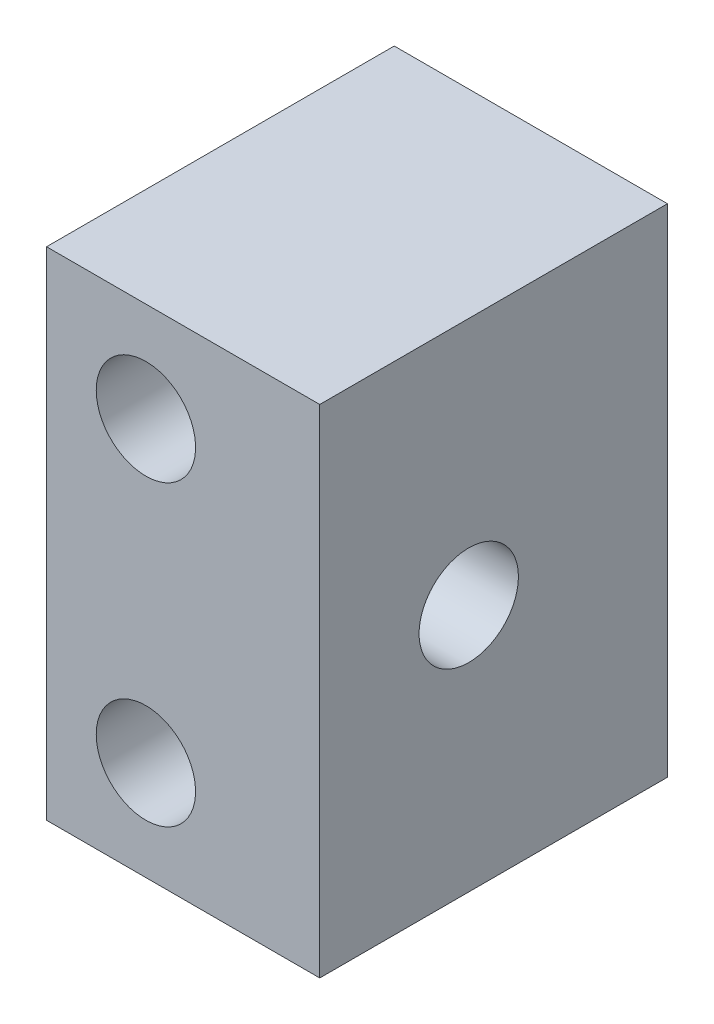
ISO-10303-21;
HEADER;
FILE_DESCRIPTION(('STEP AP214'),'2;1');
FILE_NAME('part.step','',(''),(''),'','','');
FILE_SCHEMA(('AUTOMOTIVE_DESIGN { 1 0 10303 214 1 1 1 1 }'));
ENDSEC;
DATA;
#1=APPLICATION_CONTEXT('core data for automotive mechanical design processes');
#2=APPLICATION_PROTOCOL_DEFINITION('international standard','automotive_design',2000,#1);
#3=PRODUCT_CONTEXT('',#1,'mechanical');
#4=PRODUCT('Part','Part','',(#3));
#5=PRODUCT_RELATED_PRODUCT_CATEGORY('part','',(#4));
#6=PRODUCT_DEFINITION_FORMATION('','',#4);
#7=PRODUCT_DEFINITION_CONTEXT('part definition',#1,'design');
#8=PRODUCT_DEFINITION('design','',#6,#7);
#9=PRODUCT_DEFINITION_SHAPE('','',#8);
#10=(LENGTH_UNIT() NAMED_UNIT(*) SI_UNIT(.MILLI.,.METRE.));
#11=(NAMED_UNIT(*) PLANE_ANGLE_UNIT() SI_UNIT($,.RADIAN.));
#12=(NAMED_UNIT(*) SI_UNIT($,.STERADIAN.) SOLID_ANGLE_UNIT());
#13=UNCERTAINTY_MEASURE_WITH_UNIT(LENGTH_MEASURE(1.E-05),#10,'distance_accuracy_value','');
#14=(GEOMETRIC_REPRESENTATION_CONTEXT(3) GLOBAL_UNCERTAINTY_ASSIGNED_CONTEXT((#13)) GLOBAL_UNIT_ASSIGNED_CONTEXT((#10,
#11,#12)) REPRESENTATION_CONTEXT('',''));
#15=CARTESIAN_POINT('',(0.,0.,0.));
#16=DIRECTION('',(0.,0.,1.));
#17=DIRECTION('',(1.,0.,0.));
#18=AXIS2_PLACEMENT_3D('',#15,#16,#17);
#19=CARTESIAN_POINT('',(194.999322294176,232.665580803044,4.));
#20=DIRECTION('',(0.,1.,0.));
#21=DIRECTION('',(0.,0.,1.));
#22=AXIS2_PLACEMENT_3D('',#19,#20,#21);
#23=PLANE('',#22);
#24=DIRECTION('',(-1.,0.,0.));
#25=VECTOR('',#24,1.);
#26=CARTESIAN_POINT('',(197.499322294176,232.665580803044,0.384450557859643));
#27=LINE('',#26,#25);
#28=CARTESIAN_POINT('',(197.499322294176,232.665580803044,0.384450557859643));
#29=VERTEX_POINT('',#28);
#30=CARTESIAN_POINT('',(194.999322294176,232.665580803044,0.384450557859643));
#31=VERTEX_POINT('',#30);
#32=EDGE_CURVE('E163',#29,#31,#27,.T.);
#33=ORIENTED_EDGE('',*,*,#32,.F.);
#34=DIRECTION('',(0.,0.,-1.));
#35=VECTOR('',#34,1.);
#36=CARTESIAN_POINT('',(197.499322294176,232.665580803044,4.));
#37=LINE('',#36,#35);
#38=CARTESIAN_POINT('',(197.499322294176,232.665580803044,0.));
#39=VERTEX_POINT('',#38);
#40=EDGE_CURVE('E345',#29,#39,#37,.T.);
#41=ORIENTED_EDGE('',*,*,#40,.T.);
#42=DIRECTION('',(1.,0.,0.));
#43=VECTOR('',#42,1.);
#44=CARTESIAN_POINT('',(194.999322294176,232.665580803044,0.));
#45=LINE('',#44,#43);
#46=CARTESIAN_POINT('',(194.999322294176,232.665580803044,0.));
#47=VERTEX_POINT('',#46);
#48=EDGE_CURVE('E328',#47,#39,#45,.T.);
#49=ORIENTED_EDGE('',*,*,#48,.F.);
#50=DIRECTION('',(0.,0.,-1.));
#51=VECTOR('',#50,1.);
#52=CARTESIAN_POINT('',(194.999322294176,232.665580803044,4.));
#53=LINE('',#52,#51);
#54=EDGE_CURVE('E340',#31,#47,#53,.T.);
#55=ORIENTED_EDGE('',*,*,#54,.F.);
#56=EDGE_LOOP('',(#33,#41,#49,#55));
#57=FACE_BOUND('',#56,.T.);
#58=ADVANCED_FACE('F119',(#57),#23,.T.);
#59=CARTESIAN_POINT('',(195.999322294176,234.665580803044,4.));
#60=DIRECTION('',(0.,1.,0.));
#61=DIRECTION('',(0.,0.,1.));
#62=AXIS2_PLACEMENT_3D('',#59,#60,#61);
#63=PLANE('',#62);
#64=DIRECTION('',(0.,0.,-1.));
#65=VECTOR('',#64,1.);
#66=CARTESIAN_POINT('',(197.499322294176,234.665580803044,4.));
#67=LINE('',#66,#65);
#68=CARTESIAN_POINT('',(197.499322294176,234.665580803044,0.384450557859643));
#69=VERTEX_POINT('',#68);
#70=CARTESIAN_POINT('',(197.499322294176,234.665580803044,0.));
#71=VERTEX_POINT('',#70);
#72=EDGE_CURVE('E322',#69,#71,#67,.T.);
#73=ORIENTED_EDGE('',*,*,#72,.F.);
#74=DIRECTION('',(-1.,0.,0.));
#75=VECTOR('',#74,1.);
#76=CARTESIAN_POINT('',(197.499322294176,234.665580803044,0.384450557859643));
#77=LINE('',#76,#75);
#78=CARTESIAN_POINT('',(194.999322294176,234.665580803044,0.384450557859643));
#79=VERTEX_POINT('',#78);
#80=EDGE_CURVE('E12',#69,#79,#77,.T.);
#81=ORIENTED_EDGE('',*,*,#80,.T.);
#82=DIRECTION('',(0.,0.,-1.));
#83=VECTOR('',#82,1.);
#84=CARTESIAN_POINT('',(194.999322294176,234.665580803044,4.));
#85=LINE('',#84,#83);
#86=CARTESIAN_POINT('',(194.999322294176,234.665580803044,0.));
#87=VERTEX_POINT('',#86);
#88=EDGE_CURVE('E335',#79,#87,#85,.T.);
#89=ORIENTED_EDGE('',*,*,#88,.T.);
#90=DIRECTION('',(1.,0.,0.));
#91=VECTOR('',#90,1.);
#92=CARTESIAN_POINT('',(195.999322294176,234.665580803044,0.));
#93=LINE('',#92,#91);
#94=EDGE_CURVE('E307',#87,#71,#93,.T.);
#95=ORIENTED_EDGE('',*,*,#94,.T.);
#96=EDGE_LOOP('',(#73,#81,#89,#95));
#97=FACE_BOUND('',#96,.T.);
#98=ADVANCED_FACE('F364',(#97),#63,.F.);
#99=CARTESIAN_POINT('',(194.999322294176,234.665580803044,4.));
#100=DIRECTION('',(1.,0.,0.));
#101=DIRECTION('',(0.,0.,-1.));
#102=AXIS2_PLACEMENT_3D('',#99,#100,#101);
#103=PLANE('',#102);
#104=CARTESIAN_POINT('',(194.999322294176,233.665580803044,2.));
#105=DIRECTION('',(1.,0.,0.));
#106=DIRECTION('',(0.,0.,-1.));
#107=AXIS2_PLACEMENT_3D('',#104,#105,#106);
#108=CIRCLE('',#107,1.90000000000001);
#109=CARTESIAN_POINT('',(194.999322294176,234.665580803044,3.61554944214036));
#110=VERTEX_POINT('',#109);
#111=CARTESIAN_POINT('',(194.999322294176,232.665580803044,3.61554944214036));
#112=VERTEX_POINT('',#111);
#113=EDGE_CURVE('E284',#110,#112,#108,.T.);
#114=ORIENTED_EDGE('',*,*,#113,.F.);
#115=CARTESIAN_POINT('',(194.999322294176,234.665580803044,4.));
#116=VERTEX_POINT('',#115);
#117=EDGE_CURVE('E144',#116,#110,#85,.T.);
#118=ORIENTED_EDGE('',*,*,#117,.F.);
#119=DIRECTION('',(0.,-1.,0.));
#120=VECTOR('',#119,1.);
#121=CARTESIAN_POINT('',(194.999322294176,234.665580803044,4.));
#122=LINE('',#121,#120);
#123=CARTESIAN_POINT('',(194.999322294176,232.665580803044,4.));
#124=VERTEX_POINT('',#123);
#125=EDGE_CURVE('E319',#116,#124,#122,.T.);
#126=ORIENTED_EDGE('',*,*,#125,.T.);
#127=EDGE_CURVE('E336',#124,#112,#53,.T.);
#128=ORIENTED_EDGE('',*,*,#127,.T.);
#129=EDGE_LOOP('',(#114,#118,#126,#128));
#130=FACE_BOUND('',#129,.T.);
#131=ADVANCED_FACE('F380',(#130),#103,.T.);
#132=CARTESIAN_POINT('',(199.499322294176,238.665580803044,4.));
#133=DIRECTION('',(0.,-1.,0.));
#134=DIRECTION('',(0.,0.,-1.));
#135=AXIS2_PLACEMENT_3D('',#132,#133,#134);
#136=PLANE('',#135);
#137=DIRECTION('',(0.,0.,-1.));
#138=VECTOR('',#137,1.);
#139=CARTESIAN_POINT('',(199.499322294176,238.665580803044,4.));
#140=LINE('',#139,#138);
#141=CARTESIAN_POINT('',(199.499322294176,238.665580803044,5.));
#142=VERTEX_POINT('',#141);
#143=CARTESIAN_POINT('',(199.499322294176,238.665580803044,-2.));
#144=VERTEX_POINT('',#143);
#145=EDGE_CURVE('E219',#142,#144,#140,.T.);
#146=ORIENTED_EDGE('',*,*,#145,.T.);
#147=DIRECTION('',(1.,0.,0.));
#148=VECTOR('',#147,1.);
#149=CARTESIAN_POINT('',(193.999322294176,238.665580803044,-2.));
#150=LINE('',#149,#148);
#151=CARTESIAN_POINT('',(193.999322294176,238.665580803044,-2.));
#152=VERTEX_POINT('',#151);
#153=EDGE_CURVE('E270',#152,#144,#150,.T.);
#154=ORIENTED_EDGE('',*,*,#153,.F.);
#155=DIRECTION('',(0.,0.,-1.));
#156=VECTOR('',#155,1.);
#157=CARTESIAN_POINT('',(193.999322294176,238.665580803044,4.));
#158=LINE('',#157,#156);
#159=CARTESIAN_POINT('',(193.999322294176,238.665580803044,5.));
#160=VERTEX_POINT('',#159);
#161=EDGE_CURVE('E234',#160,#152,#158,.T.);
#162=ORIENTED_EDGE('',*,*,#161,.F.);
#163=DIRECTION('',(-1.,0.,0.));
#164=VECTOR('',#163,1.);
#165=CARTESIAN_POINT('',(199.499322294176,238.665580803044,5.));
#166=LINE('',#165,#164);
#167=EDGE_CURVE('E233',#142,#160,#166,.T.);
#168=ORIENTED_EDGE('',*,*,#167,.F.);
#169=EDGE_LOOP('',(#146,#154,#162,#168));
#170=FACE_BOUND('',#169,.T.);
#171=ADVANCED_FACE('F121',(#170),#136,.F.);
#172=CARTESIAN_POINT('',(193.999322294176,228.665580803044,4.));
#173=DIRECTION('',(-1.,0.,0.));
#174=DIRECTION('',(0.,0.,1.));
#175=AXIS2_PLACEMENT_3D('',#172,#173,#174);
#176=PLANE('',#175);
#177=CARTESIAN_POINT('',(193.999322294176,233.665580803044,2.));
#178=DIRECTION('',(-1.,0.,0.));
#179=DIRECTION('',(0.,0.,1.));
#180=AXIS2_PLACEMENT_3D('',#177,#178,#179);
#181=CIRCLE('',#180,1.90000000000001);
#182=CARTESIAN_POINT('',(193.999322294176,233.665580803044,3.90000000000001));
#183=VERTEX_POINT('',#182);
#184=EDGE_CURVE('E279',#183,#183,#181,.T.);
#185=ORIENTED_EDGE('',*,*,#184,.F.);
#186=EDGE_LOOP('',(#185));
#187=FACE_BOUND('',#186,.T.);
#188=ORIENTED_EDGE('',*,*,#161,.T.);
#189=DIRECTION('',(0.,1.,0.));
#190=VECTOR('',#189,1.);
#191=CARTESIAN_POINT('',(193.999322294176,228.665580803044,-2.));
#192=LINE('',#191,#190);
#193=CARTESIAN_POINT('',(193.999322294176,228.665580803044,-2.));
#194=VERTEX_POINT('',#193);
#195=EDGE_CURVE('E266',#194,#152,#192,.T.);
#196=ORIENTED_EDGE('',*,*,#195,.F.);
#197=DIRECTION('',(0.,0.,-1.));
#198=VECTOR('',#197,1.);
#199=CARTESIAN_POINT('',(193.999322294176,228.665580803044,4.));
#200=LINE('',#199,#198);
#201=CARTESIAN_POINT('',(193.999322294176,228.665580803044,5.));
#202=VERTEX_POINT('',#201);
#203=EDGE_CURVE('E351',#202,#194,#200,.T.);
#204=ORIENTED_EDGE('',*,*,#203,.F.);
#205=DIRECTION('',(0.,-1.,0.));
#206=VECTOR('',#205,1.);
#207=CARTESIAN_POINT('',(193.999322294176,238.665580803044,5.));
#208=LINE('',#207,#206);
#209=EDGE_CURVE('E239',#160,#202,#208,.T.);
#210=ORIENTED_EDGE('',*,*,#209,.F.);
#211=EDGE_LOOP('',(#188,#196,#204,#210));
#212=FACE_BOUND('',#211,.T.);
#213=ADVANCED_FACE('F389',(#187,#212),#176,.T.);
#214=CARTESIAN_POINT('',(199.499322294176,228.665580803044,4.));
#215=DIRECTION('',(0.,-1.,0.));
#216=DIRECTION('',(0.,0.,-1.));
#217=AXIS2_PLACEMENT_3D('',#214,#215,#216);
#218=PLANE('',#217);
#219=ORIENTED_EDGE('',*,*,#203,.T.);
#220=DIRECTION('',(-1.,0.,0.));
#221=VECTOR('',#220,1.);
#222=CARTESIAN_POINT('',(199.499322294176,228.665580803044,-2.));
#223=LINE('',#222,#221);
#224=CARTESIAN_POINT('',(199.499322294176,228.665580803044,-2.));
#225=VERTEX_POINT('',#224);
#226=EDGE_CURVE('E275',#225,#194,#223,.T.);
#227=ORIENTED_EDGE('',*,*,#226,.F.);
#228=DIRECTION('',(0.,0.,-1.));
#229=VECTOR('',#228,1.);
#230=CARTESIAN_POINT('',(199.499322294176,228.665580803044,4.));
#231=LINE('',#230,#229);
#232=CARTESIAN_POINT('',(199.499322294176,228.665580803044,5.));
#233=VERTEX_POINT('',#232);
#234=EDGE_CURVE('E230',#233,#225,#231,.T.);
#235=ORIENTED_EDGE('',*,*,#234,.F.);
#236=DIRECTION('',(1.,0.,0.));
#237=VECTOR('',#236,1.);
#238=CARTESIAN_POINT('',(193.999322294176,228.665580803044,5.));
#239=LINE('',#238,#237);
#240=EDGE_CURVE('E244',#202,#233,#239,.T.);
#241=ORIENTED_EDGE('',*,*,#240,.F.);
#242=EDGE_LOOP('',(#219,#227,#235,#241));
#243=FACE_BOUND('',#242,.T.);
#244=ADVANCED_FACE('F392',(#243),#218,.T.);
#245=CARTESIAN_POINT('',(199.499322294176,238.665580803044,4.));
#246=DIRECTION('',(1.,0.,0.));
#247=DIRECTION('',(0.,0.,-1.));
#248=AXIS2_PLACEMENT_3D('',#245,#246,#247);
#249=PLANE('',#248);
#250=CARTESIAN_POINT('',(199.499322294176,233.665580803044,2.));
#251=DIRECTION('',(1.,0.,0.));
#252=DIRECTION('',(0.,0.,-1.));
#253=AXIS2_PLACEMENT_3D('',#250,#251,#252);
#254=CIRCLE('',#253,0.999999999999999);
#255=CARTESIAN_POINT('',(199.499322294176,233.665580803044,1.));
#256=VERTEX_POINT('',#255);
#257=EDGE_CURVE('E303',#256,#256,#254,.F.);
#258=ORIENTED_EDGE('',*,*,#257,.T.);
#259=EDGE_LOOP('',(#258));
#260=FACE_BOUND('',#259,.T.);
#261=ORIENTED_EDGE('',*,*,#234,.T.);
#262=DIRECTION('',(0.,-1.,0.));
#263=VECTOR('',#262,1.);
#264=CARTESIAN_POINT('',(199.499322294176,238.665580803044,-2.));
#265=LINE('',#264,#263);
#266=EDGE_CURVE('E225',#144,#225,#265,.T.);
#267=ORIENTED_EDGE('',*,*,#266,.F.);
#268=ORIENTED_EDGE('',*,*,#145,.F.);
#269=DIRECTION('',(0.,1.,0.));
#270=VECTOR('',#269,1.);
#271=CARTESIAN_POINT('',(199.499322294176,228.665580803044,5.));
#272=LINE('',#271,#270);
#273=EDGE_CURVE('E223',#233,#142,#272,.T.);
#274=ORIENTED_EDGE('',*,*,#273,.F.);
#275=EDGE_LOOP('',(#261,#267,#268,#274));
#276=FACE_BOUND('',#275,.T.);
#277=ADVANCED_FACE('F221',(#260,#276),#249,.T.);
#278=CARTESIAN_POINT('',(195.999322294176,230.665580803044,4.));
#279=DIRECTION('',(0.,0.,-1.));
#280=DIRECTION('',(-1.,0.,0.));
#281=AXIS2_PLACEMENT_3D('',#278,#279,#280);
#282=CYLINDRICAL_SURFACE('',#281,1.);
#283=CARTESIAN_POINT('',(195.999322294176,230.665580803044,-2.));
#284=DIRECTION('',(0.,0.,1.));
#285=DIRECTION('',(1.,0.,0.));
#286=AXIS2_PLACEMENT_3D('',#283,#284,#285);
#287=CIRCLE('',#286,0.999999999999998);
#288=CARTESIAN_POINT('',(196.999322294176,230.665580803044,-2.));
#289=VERTEX_POINT('',#288);
#290=EDGE_CURVE('E258',#289,#289,#287,.T.);
#291=ORIENTED_EDGE('',*,*,#290,.F.);
#292=EDGE_LOOP('',(#291));
#293=FACE_BOUND('',#292,.T.);
#294=CARTESIAN_POINT('',(195.999322294176,230.665580803044,5.));
#295=DIRECTION('',(0.,0.,-1.));
#296=DIRECTION('',(-1.,0.,0.));
#297=AXIS2_PLACEMENT_3D('',#294,#295,#296);
#298=CIRCLE('',#297,0.999999999999998);
#299=CARTESIAN_POINT('',(194.999322294176,230.665580803044,5.));
#300=VERTEX_POINT('',#299);
#301=EDGE_CURVE('E250',#300,#300,#298,.T.);
#302=ORIENTED_EDGE('',*,*,#301,.F.);
#303=EDGE_LOOP('',(#302));
#304=FACE_BOUND('',#303,.T.);
#305=ADVANCED_FACE('F403',(#293,#304),#282,.F.);
#306=CARTESIAN_POINT('',(195.999322294176,236.665580803044,4.));
#307=DIRECTION('',(0.,0.,-1.));
#308=DIRECTION('',(-1.,0.,0.));
#309=AXIS2_PLACEMENT_3D('',#306,#307,#308);
#310=CYLINDRICAL_SURFACE('',#309,1.);
#311=CARTESIAN_POINT('',(195.999322294176,236.665580803044,-2.));
#312=DIRECTION('',(0.,0.,1.));
#313=DIRECTION('',(1.,0.,0.));
#314=AXIS2_PLACEMENT_3D('',#311,#312,#313);
#315=CIRCLE('',#314,0.999999999999998);
#316=CARTESIAN_POINT('',(196.999322294176,236.665580803044,-2.));
#317=VERTEX_POINT('',#316);
#318=EDGE_CURVE('E262',#317,#317,#315,.T.);
#319=ORIENTED_EDGE('',*,*,#318,.F.);
#320=EDGE_LOOP('',(#319));
#321=FACE_BOUND('',#320,.T.);
#322=CARTESIAN_POINT('',(195.999322294176,236.665580803044,5.));
#323=DIRECTION('',(0.,0.,-1.));
#324=DIRECTION('',(-1.,0.,0.));
#325=AXIS2_PLACEMENT_3D('',#322,#323,#324);
#326=CIRCLE('',#325,0.999999999999998);
#327=CARTESIAN_POINT('',(194.999322294176,236.665580803044,5.));
#328=VERTEX_POINT('',#327);
#329=EDGE_CURVE('E246',#328,#328,#326,.T.);
#330=ORIENTED_EDGE('',*,*,#329,.F.);
#331=EDGE_LOOP('',(#330));
#332=FACE_BOUND('',#331,.T.);
#333=ADVANCED_FACE('F421',(#321,#332),#310,.F.);
#334=CARTESIAN_POINT('',(194.999322294176,233.665580803044,2.));
#335=DIRECTION('',(1.,0.,0.));
#336=DIRECTION('',(0.,0.,-1.));
#337=AXIS2_PLACEMENT_3D('',#334,#335,#336);
#338=CIRCLE('',#337,1.90000000000001);
#339=EDGE_CURVE('E294',#31,#79,#338,.T.);
#340=ORIENTED_EDGE('',*,*,#339,.F.);
#341=ORIENTED_EDGE('',*,*,#54,.T.);
#342=DIRECTION('',(0.,-1.,0.));
#343=VECTOR('',#342,1.);
#344=CARTESIAN_POINT('',(194.999322294176,234.665580803044,0.));
#345=LINE('',#344,#343);
#346=EDGE_CURVE('E312',#87,#47,#345,.T.);
#347=ORIENTED_EDGE('',*,*,#346,.F.);
#348=ORIENTED_EDGE('',*,*,#88,.F.);
#349=EDGE_LOOP('',(#340,#341,#347,#348));
#350=FACE_BOUND('',#349,.T.);
#351=ADVANCED_FACE('F416',(#350),#103,.T.);
#352=DIRECTION('',(-1.,0.,0.));
#353=VECTOR('',#352,1.);
#354=CARTESIAN_POINT('',(197.499322294176,232.665580803044,3.61554944214036));
#355=LINE('',#354,#353);
#356=CARTESIAN_POINT('',(197.499322294176,232.665580803044,3.61554944214036));
#357=VERTEX_POINT('',#356);
#358=EDGE_CURVE('E291',#112,#357,#355,.F.);
#359=ORIENTED_EDGE('',*,*,#358,.F.);
#360=ORIENTED_EDGE('',*,*,#127,.F.);
#361=DIRECTION('',(1.,0.,0.));
#362=VECTOR('',#361,1.);
#363=CARTESIAN_POINT('',(195.999322294176,232.665580803044,4.));
#364=LINE('',#363,#362);
#365=CARTESIAN_POINT('',(197.499322294176,232.665580803044,4.));
#366=VERTEX_POINT('',#365);
#367=EDGE_CURVE('E315',#124,#366,#364,.T.);
#368=ORIENTED_EDGE('',*,*,#367,.T.);
#369=EDGE_CURVE('E341',#366,#357,#37,.T.);
#370=ORIENTED_EDGE('',*,*,#369,.T.);
#371=EDGE_LOOP('',(#359,#360,#368,#370));
#372=FACE_BOUND('',#371,.T.);
#373=ADVANCED_FACE('F374',(#372),#23,.T.);
#374=CARTESIAN_POINT('',(197.499322294176,234.665580803044,4.));
#375=DIRECTION('',(1.,0.,0.));
#376=DIRECTION('',(0.,0.,-1.));
#377=AXIS2_PLACEMENT_3D('',#374,#375,#376);
#378=PLANE('',#377);
#379=ORIENTED_EDGE('',*,*,#40,.F.);
#380=CARTESIAN_POINT('',(197.499322294176,233.665580803044,2.));
#381=DIRECTION('',(-1.,0.,0.));
#382=DIRECTION('',(0.,0.,1.));
#383=AXIS2_PLACEMENT_3D('',#380,#381,#382);
#384=CIRCLE('',#383,1.90000000000001);
#385=EDGE_CURVE('E285',#29,#357,#384,.T.);
#386=ORIENTED_EDGE('',*,*,#385,.T.);
#387=ORIENTED_EDGE('',*,*,#369,.F.);
#388=DIRECTION('',(0.,-1.,0.));
#389=VECTOR('',#388,1.);
#390=CARTESIAN_POINT('',(197.499322294176,234.665580803044,4.));
#391=LINE('',#390,#389);
#392=CARTESIAN_POINT('',(197.499322294176,234.665580803044,4.));
#393=VERTEX_POINT('',#392);
#394=EDGE_CURVE('E135',#393,#366,#391,.T.);
#395=ORIENTED_EDGE('',*,*,#394,.F.);
#396=CARTESIAN_POINT('',(197.499322294176,234.665580803044,3.61554944214036));
#397=VERTEX_POINT('',#396);
#398=EDGE_CURVE('E346',#393,#397,#67,.T.);
#399=ORIENTED_EDGE('',*,*,#398,.T.);
#400=EDGE_CURVE('E280',#397,#69,#384,.T.);
#401=ORIENTED_EDGE('',*,*,#400,.T.);
#402=ORIENTED_EDGE('',*,*,#72,.T.);
#403=DIRECTION('',(0.,-1.,0.));
#404=VECTOR('',#403,1.);
#405=CARTESIAN_POINT('',(197.499322294176,234.665580803044,0.));
#406=LINE('',#405,#404);
#407=EDGE_CURVE('E155',#71,#39,#406,.T.);
#408=ORIENTED_EDGE('',*,*,#407,.T.);
#409=EDGE_LOOP('',(#379,#386,#387,#395,#399,#401,#402,#408));
#410=FACE_BOUND('',#409,.T.);
#411=CARTESIAN_POINT('',(197.499322294176,233.665580803044,2.));
#412=DIRECTION('',(1.,0.,0.));
#413=DIRECTION('',(0.,0.,-1.));
#414=AXIS2_PLACEMENT_3D('',#411,#412,#413);
#415=CIRCLE('',#414,0.999999999999999);
#416=CARTESIAN_POINT('',(197.499322294176,233.665580803044,1.));
#417=VERTEX_POINT('',#416);
#418=EDGE_CURVE('E299',#417,#417,#415,.F.);
#419=ORIENTED_EDGE('',*,*,#418,.F.);
#420=EDGE_LOOP('',(#419));
#421=FACE_BOUND('',#420,.T.);
#422=ADVANCED_FACE('F360',(#410,#421),#378,.F.);
#423=ORIENTED_EDGE('',*,*,#117,.T.);
#424=DIRECTION('',(-1.,0.,0.));
#425=VECTOR('',#424,1.);
#426=CARTESIAN_POINT('',(197.499322294176,234.665580803044,3.61554944214036));
#427=LINE('',#426,#425);
#428=EDGE_CURVE('E128',#110,#397,#427,.F.);
#429=ORIENTED_EDGE('',*,*,#428,.T.);
#430=ORIENTED_EDGE('',*,*,#398,.F.);
#431=DIRECTION('',(1.,0.,0.));
#432=VECTOR('',#431,1.);
#433=CARTESIAN_POINT('',(194.999322294176,234.665580803044,4.));
#434=LINE('',#433,#432);
#435=EDGE_CURVE('E308',#116,#393,#434,.T.);
#436=ORIENTED_EDGE('',*,*,#435,.F.);
#437=EDGE_LOOP('',(#423,#429,#430,#436));
#438=FACE_BOUND('',#437,.T.);
#439=ADVANCED_FACE('F358',(#438),#63,.F.);
#440=CARTESIAN_POINT('',(192.499322294176,233.665580803044,2.));
#441=DIRECTION('',(1.,0.,0.));
#442=DIRECTION('',(0.,0.,-1.));
#443=AXIS2_PLACEMENT_3D('',#440,#441,#442);
#444=CYLINDRICAL_SURFACE('',#443,0.999999999999999);
#445=ORIENTED_EDGE('',*,*,#257,.F.);
#446=EDGE_LOOP('',(#445));
#447=FACE_BOUND('',#446,.T.);
#448=ORIENTED_EDGE('',*,*,#418,.T.);
#449=EDGE_LOOP('',(#448));
#450=FACE_BOUND('',#449,.T.);
#451=ADVANCED_FACE('F385',(#447,#450),#444,.F.);
#452=CARTESIAN_POINT('',(197.499322294176,233.665580803044,2.));
#453=DIRECTION('',(-1.,0.,0.));
#454=DIRECTION('',(0.,0.,1.));
#455=AXIS2_PLACEMENT_3D('',#452,#453,#454);
#456=CYLINDRICAL_SURFACE('',#455,1.90000000000001);
#457=ORIENTED_EDGE('',*,*,#32,.T.);
#458=ORIENTED_EDGE('',*,*,#339,.T.);
#459=ORIENTED_EDGE('',*,*,#80,.F.);
#460=ORIENTED_EDGE('',*,*,#400,.F.);
#461=ORIENTED_EDGE('',*,*,#428,.F.);
#462=ORIENTED_EDGE('',*,*,#113,.T.);
#463=ORIENTED_EDGE('',*,*,#358,.T.);
#464=ORIENTED_EDGE('',*,*,#385,.F.);
#465=EDGE_LOOP('',(#457,#458,#459,#460,#461,#462,#463,#464));
#466=FACE_BOUND('',#465,.T.);
#467=ORIENTED_EDGE('',*,*,#184,.T.);
#468=EDGE_LOOP('',(#467));
#469=FACE_BOUND('',#468,.T.);
#470=ADVANCED_FACE('F381',(#466,#469),#456,.F.);
#471=CARTESIAN_POINT('',(0.,0.,0.));
#472=DIRECTION('',(0.,0.,-1.));
#473=DIRECTION('',(-1.,0.,0.));
#474=AXIS2_PLACEMENT_3D('',#471,#472,#473);
#475=PLANE('',#474);
#476=ORIENTED_EDGE('',*,*,#94,.F.);
#477=ORIENTED_EDGE('',*,*,#346,.T.);
#478=ORIENTED_EDGE('',*,*,#48,.T.);
#479=ORIENTED_EDGE('',*,*,#407,.F.);
#480=EDGE_LOOP('',(#476,#477,#478,#479));
#481=FACE_BOUND('',#480,.T.);
#482=ADVANCED_FACE('F384',(#481),#475,.F.);
#483=CARTESIAN_POINT('',(0.,0.,-2.));
#484=DIRECTION('',(0.,0.,-1.));
#485=DIRECTION('',(-1.,0.,0.));
#486=AXIS2_PLACEMENT_3D('',#483,#484,#485);
#487=PLANE('',#486);
#488=ORIENTED_EDGE('',*,*,#290,.T.);
#489=EDGE_LOOP('',(#488));
#490=FACE_BOUND('',#489,.T.);
#491=ORIENTED_EDGE('',*,*,#318,.T.);
#492=EDGE_LOOP('',(#491));
#493=FACE_BOUND('',#492,.T.);
#494=ORIENTED_EDGE('',*,*,#195,.T.);
#495=ORIENTED_EDGE('',*,*,#153,.T.);
#496=ORIENTED_EDGE('',*,*,#266,.T.);
#497=ORIENTED_EDGE('',*,*,#226,.T.);
#498=EDGE_LOOP('',(#494,#495,#496,#497));
#499=FACE_BOUND('',#498,.T.);
#500=ADVANCED_FACE('F395',(#490,#493,#499),#487,.T.);
#501=CARTESIAN_POINT('',(0.,0.,4.));
#502=DIRECTION('',(0.,0.,1.));
#503=DIRECTION('',(1.,0.,0.));
#504=AXIS2_PLACEMENT_3D('',#501,#502,#503);
#505=PLANE('',#504);
#506=ORIENTED_EDGE('',*,*,#367,.F.);
#507=ORIENTED_EDGE('',*,*,#125,.F.);
#508=ORIENTED_EDGE('',*,*,#435,.T.);
#509=ORIENTED_EDGE('',*,*,#394,.T.);
#510=EDGE_LOOP('',(#506,#507,#508,#509));
#511=FACE_BOUND('',#510,.T.);
#512=ADVANCED_FACE('F379',(#511),#505,.F.);
#513=CARTESIAN_POINT('',(0.,0.,5.));
#514=DIRECTION('',(0.,0.,1.));
#515=DIRECTION('',(1.,0.,0.));
#516=AXIS2_PLACEMENT_3D('',#513,#514,#515);
#517=PLANE('',#516);
#518=ORIENTED_EDGE('',*,*,#329,.T.);
#519=EDGE_LOOP('',(#518));
#520=FACE_BOUND('',#519,.T.);
#521=ORIENTED_EDGE('',*,*,#301,.T.);
#522=EDGE_LOOP('',(#521));
#523=FACE_BOUND('',#522,.T.);
#524=ORIENTED_EDGE('',*,*,#273,.T.);
#525=ORIENTED_EDGE('',*,*,#167,.T.);
#526=ORIENTED_EDGE('',*,*,#209,.T.);
#527=ORIENTED_EDGE('',*,*,#240,.T.);
#528=EDGE_LOOP('',(#524,#525,#526,#527));
#529=FACE_BOUND('',#528,.T.);
#530=ADVANCED_FACE('F242',(#520,#523,#529),#517,.T.);
#531=CLOSED_SHELL('',(#58,#98,#131,#171,#213,#244,#277,#305,#333,#351,#373,#422,#439,#451,#470,
#482,#500,#512,#530));
#532=MANIFOLD_SOLID_BREP('B2',#531);
#533=ADVANCED_BREP_SHAPE_REPRESENTATION('',(#18,#532),#14);
#534=SHAPE_DEFINITION_REPRESENTATION(#9,#533);
ENDSEC;
END-ISO-10303-21;
